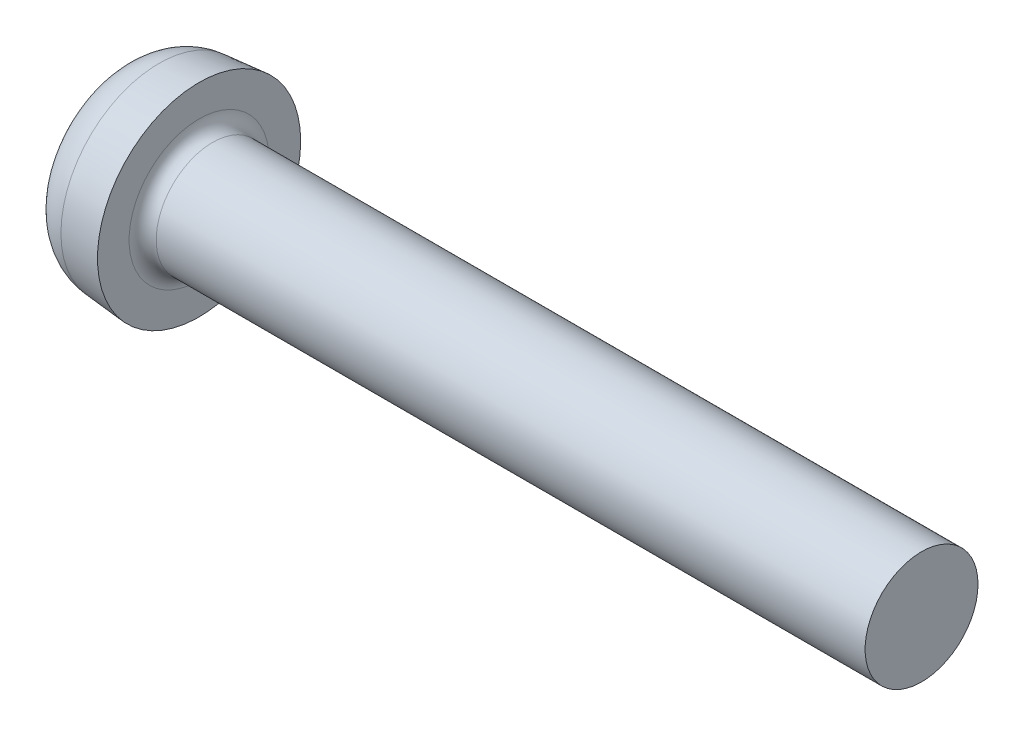
ISO-10303-21;
HEADER;
FILE_DESCRIPTION(('STEP AP214'),'2;1');
FILE_NAME('part.step','',(''),(''),'','','');
FILE_SCHEMA(('AUTOMOTIVE_DESIGN { 1 0 10303 214 1 1 1 1 }'));
ENDSEC;
DATA;
#1=APPLICATION_CONTEXT('core data for automotive mechanical design processes');
#2=APPLICATION_PROTOCOL_DEFINITION('international standard','automotive_design',2000,#1);
#3=PRODUCT_CONTEXT('',#1,'mechanical');
#4=PRODUCT('Part','Part','',(#3));
#5=PRODUCT_RELATED_PRODUCT_CATEGORY('part','',(#4));
#6=PRODUCT_DEFINITION_FORMATION('','',#4);
#7=PRODUCT_DEFINITION_CONTEXT('part definition',#1,'design');
#8=PRODUCT_DEFINITION('design','',#6,#7);
#9=PRODUCT_DEFINITION_SHAPE('','',#8);
#10=(LENGTH_UNIT() NAMED_UNIT(*) SI_UNIT(.MILLI.,.METRE.));
#11=(NAMED_UNIT(*) PLANE_ANGLE_UNIT() SI_UNIT($,.RADIAN.));
#12=(NAMED_UNIT(*) SI_UNIT($,.STERADIAN.) SOLID_ANGLE_UNIT());
#13=UNCERTAINTY_MEASURE_WITH_UNIT(LENGTH_MEASURE(1.E-05),#10,'distance_accuracy_value','');
#14=(GEOMETRIC_REPRESENTATION_CONTEXT(3) GLOBAL_UNCERTAINTY_ASSIGNED_CONTEXT((#13)) GLOBAL_UNIT_ASSIGNED_CONTEXT((#10,
#11,#12)) REPRESENTATION_CONTEXT('',''));
#15=CARTESIAN_POINT('',(0.,0.,0.));
#16=DIRECTION('',(0.,0.,1.));
#17=DIRECTION('',(1.,0.,0.));
#18=AXIS2_PLACEMENT_3D('',#15,#16,#17);
#19=CARTESIAN_POINT('',(0.,0.,0.));
#20=DIRECTION('',(-1.,0.,0.));
#21=DIRECTION('',(0.,0.,1.));
#22=AXIS2_PLACEMENT_3D('',#19,#20,#21);
#23=PLANE('',#22);
#24=DIRECTION('',(0.,1.,0.));
#25=VECTOR('',#24,1.);
#26=CARTESIAN_POINT('',(0.,0.27,-0.27));
#27=LINE('',#26,#25);
#28=CARTESIAN_POINT('',(0.,0.57,-0.27));
#29=VERTEX_POINT('',#28);
#30=CARTESIAN_POINT('',(0.,1.14477993894734,-0.27));
#31=VERTEX_POINT('',#30);
#32=EDGE_CURVE('E331',#29,#31,#27,.T.);
#33=ORIENTED_EDGE('',*,*,#32,.T.);
#34=CARTESIAN_POINT('',(0.,0.,0.));
#35=DIRECTION('',(-1.,0.,0.));
#36=DIRECTION('',(0.,0.,1.));
#37=AXIS2_PLACEMENT_3D('',#34,#35,#36);
#38=CIRCLE('',#37,1.17618923163591);
#39=CARTESIAN_POINT('',(0.,0.27,-1.14477993894734));
#40=VERTEX_POINT('',#39);
#41=EDGE_CURVE('E296',#31,#40,#38,.T.);
#42=ORIENTED_EDGE('',*,*,#41,.T.);
#43=DIRECTION('',(0.,0.,1.));
#44=VECTOR('',#43,1.);
#45=CARTESIAN_POINT('',(0.,0.27,-0.27));
#46=LINE('',#45,#44);
#47=CARTESIAN_POINT('',(0.,0.27,-0.57));
#48=VERTEX_POINT('',#47);
#49=EDGE_CURVE('E309',#40,#48,#46,.T.);
#50=ORIENTED_EDGE('',*,*,#49,.T.);
#51=CARTESIAN_POINT('',(0.,0.57,-0.57));
#52=DIRECTION('',(-1.,0.,0.));
#53=DIRECTION('',(0.,0.,1.));
#54=AXIS2_PLACEMENT_3D('',#51,#52,#53);
#55=CIRCLE('',#54,0.3);
#56=EDGE_CURVE('E358',#48,#29,#55,.T.);
#57=ORIENTED_EDGE('',*,*,#56,.T.);
#58=EDGE_LOOP('',(#33,#42,#50,#57));
#59=FACE_BOUND('',#58,.T.);
#60=ADVANCED_FACE('F38',(#59),#23,.T.);
#61=DIRECTION('',(0.,0.,-1.));
#62=VECTOR('',#61,1.);
#63=CARTESIAN_POINT('',(0.,-0.27,-0.27));
#64=LINE('',#63,#62);
#65=CARTESIAN_POINT('',(0.,-0.27,-0.57));
#66=VERTEX_POINT('',#65);
#67=CARTESIAN_POINT('',(0.,-0.27,-1.14477993894734));
#68=VERTEX_POINT('',#67);
#69=EDGE_CURVE('E324',#66,#68,#64,.T.);
#70=ORIENTED_EDGE('',*,*,#69,.T.);
#71=CARTESIAN_POINT('',(0.,0.,0.));
#72=DIRECTION('',(-1.,0.,0.));
#73=DIRECTION('',(0.,0.,1.));
#74=AXIS2_PLACEMENT_3D('',#71,#72,#73);
#75=CIRCLE('',#74,1.17618923163591);
#76=CARTESIAN_POINT('',(0.,-1.14477993894734,-0.27));
#77=VERTEX_POINT('',#76);
#78=EDGE_CURVE('E288',#68,#77,#75,.T.);
#79=ORIENTED_EDGE('',*,*,#78,.T.);
#80=DIRECTION('',(0.,1.,0.));
#81=VECTOR('',#80,1.);
#82=CARTESIAN_POINT('',(0.,-0.27,-0.27));
#83=LINE('',#82,#81);
#84=CARTESIAN_POINT('',(0.,-0.57,-0.27));
#85=VERTEX_POINT('',#84);
#86=EDGE_CURVE('E112',#77,#85,#83,.T.);
#87=ORIENTED_EDGE('',*,*,#86,.T.);
#88=CARTESIAN_POINT('',(0.,-0.57,-0.57));
#89=DIRECTION('',(-1.,0.,0.));
#90=DIRECTION('',(0.,0.,1.));
#91=AXIS2_PLACEMENT_3D('',#88,#89,#90);
#92=CIRCLE('',#91,0.3);
#93=EDGE_CURVE('E329',#85,#66,#92,.T.);
#94=ORIENTED_EDGE('',*,*,#93,.T.);
#95=EDGE_LOOP('',(#70,#79,#87,#94));
#96=FACE_BOUND('',#95,.T.);
#97=ADVANCED_FACE('F239',(#96),#23,.T.);
#98=DIRECTION('',(0.,-1.,0.));
#99=VECTOR('',#98,1.);
#100=CARTESIAN_POINT('',(0.,-0.27,0.27));
#101=LINE('',#100,#99);
#102=CARTESIAN_POINT('',(0.,-0.57,0.27));
#103=VERTEX_POINT('',#102);
#104=CARTESIAN_POINT('',(0.,-1.14477993894734,0.269999999999999));
#105=VERTEX_POINT('',#104);
#106=EDGE_CURVE('E333',#103,#105,#101,.T.);
#107=ORIENTED_EDGE('',*,*,#106,.T.);
#108=CARTESIAN_POINT('',(0.,0.,0.));
#109=DIRECTION('',(-1.,0.,0.));
#110=DIRECTION('',(0.,0.,1.));
#111=AXIS2_PLACEMENT_3D('',#108,#109,#110);
#112=CIRCLE('',#111,1.17618923163591);
#113=CARTESIAN_POINT('',(0.,-0.27,1.14477993894734));
#114=VERTEX_POINT('',#113);
#115=EDGE_CURVE('E284',#105,#114,#112,.T.);
#116=ORIENTED_EDGE('',*,*,#115,.T.);
#117=DIRECTION('',(0.,0.,-1.));
#118=VECTOR('',#117,1.);
#119=CARTESIAN_POINT('',(0.,-0.27,0.27));
#120=LINE('',#119,#118);
#121=CARTESIAN_POINT('',(0.,-0.27,0.57));
#122=VERTEX_POINT('',#121);
#123=EDGE_CURVE('E279',#114,#122,#120,.T.);
#124=ORIENTED_EDGE('',*,*,#123,.T.);
#125=CARTESIAN_POINT('',(0.,-0.57,0.57));
#126=DIRECTION('',(-1.,0.,0.));
#127=DIRECTION('',(0.,0.,1.));
#128=AXIS2_PLACEMENT_3D('',#125,#126,#127);
#129=CIRCLE('',#128,0.3);
#130=EDGE_CURVE('E363',#122,#103,#129,.T.);
#131=ORIENTED_EDGE('',*,*,#130,.T.);
#132=EDGE_LOOP('',(#107,#116,#124,#131));
#133=FACE_BOUND('',#132,.T.);
#134=ADVANCED_FACE('F246',(#133),#23,.T.);
#135=DIRECTION('',(0.,0.,1.));
#136=VECTOR('',#135,1.);
#137=CARTESIAN_POINT('',(0.,0.27,0.27));
#138=LINE('',#137,#136);
#139=CARTESIAN_POINT('',(0.,0.27,0.57));
#140=VERTEX_POINT('',#139);
#141=CARTESIAN_POINT('',(0.,0.27,1.14477993894734));
#142=VERTEX_POINT('',#141);
#143=EDGE_CURVE('E265',#140,#142,#138,.T.);
#144=ORIENTED_EDGE('',*,*,#143,.T.);
#145=CARTESIAN_POINT('',(0.,0.,0.));
#146=DIRECTION('',(-1.,0.,0.));
#147=DIRECTION('',(0.,0.,1.));
#148=AXIS2_PLACEMENT_3D('',#145,#146,#147);
#149=CIRCLE('',#148,1.17618923163591);
#150=CARTESIAN_POINT('',(0.,1.14477993894734,0.27));
#151=VERTEX_POINT('',#150);
#152=EDGE_CURVE('E269',#142,#151,#149,.T.);
#153=ORIENTED_EDGE('',*,*,#152,.T.);
#154=DIRECTION('',(0.,-1.,0.));
#155=VECTOR('',#154,1.);
#156=CARTESIAN_POINT('',(0.,0.27,0.27));
#157=LINE('',#156,#155);
#158=CARTESIAN_POINT('',(0.,0.57,0.27));
#159=VERTEX_POINT('',#158);
#160=EDGE_CURVE('E338',#151,#159,#157,.T.);
#161=ORIENTED_EDGE('',*,*,#160,.T.);
#162=CARTESIAN_POINT('',(0.,0.57,0.57));
#163=DIRECTION('',(-1.,0.,0.));
#164=DIRECTION('',(0.,0.,1.));
#165=AXIS2_PLACEMENT_3D('',#162,#163,#164);
#166=CIRCLE('',#165,0.3);
#167=EDGE_CURVE('E273',#159,#140,#166,.T.);
#168=ORIENTED_EDGE('',*,*,#167,.T.);
#169=EDGE_LOOP('',(#144,#153,#161,#168));
#170=FACE_BOUND('',#169,.T.);
#171=ADVANCED_FACE('F242',(#170),#23,.T.);
#172=CARTESIAN_POINT('',(17.8,1.25,0.));
#173=DIRECTION('',(1.,0.,0.));
#174=DIRECTION('',(0.,0.,-1.));
#175=AXIS2_PLACEMENT_3D('',#172,#173,#174);
#176=PLANE('',#175);
#177=CARTESIAN_POINT('',(17.8,0.,0.));
#178=DIRECTION('',(1.,0.,0.));
#179=DIRECTION('',(0.,0.,-1.));
#180=AXIS2_PLACEMENT_3D('',#177,#178,#179);
#181=CIRCLE('',#180,1.25);
#182=CARTESIAN_POINT('',(17.8,0.,-1.25));
#183=VERTEX_POINT('',#182);
#184=EDGE_CURVE('E352',#183,#183,#181,.T.);
#185=ORIENTED_EDGE('',*,*,#184,.T.);
#186=EDGE_LOOP('',(#185));
#187=FACE_BOUND('',#186,.T.);
#188=ADVANCED_FACE('F251',(#187),#176,.T.);
#189=CARTESIAN_POINT('',(4.51581291088132,0.,0.));
#190=DIRECTION('',(1.,0.,0.));
#191=DIRECTION('',(0.,0.,-1.));
#192=AXIS2_PLACEMENT_3D('',#189,#190,#191);
#193=CYLINDRICAL_SURFACE('',#192,1.25);
#194=CARTESIAN_POINT('',(2.1,0.,0.));
#195=DIRECTION('',(1.,0.,0.));
#196=DIRECTION('',(0.,0.,-1.));
#197=AXIS2_PLACEMENT_3D('',#194,#195,#196);
#198=CIRCLE('',#197,1.25);
#199=CARTESIAN_POINT('',(2.1,0.,-1.25));
#200=VERTEX_POINT('',#199);
#201=EDGE_CURVE('E349',#200,#200,#198,.T.);
#202=ORIENTED_EDGE('',*,*,#201,.T.);
#203=EDGE_LOOP('',(#202));
#204=FACE_BOUND('',#203,.T.);
#205=ORIENTED_EDGE('',*,*,#184,.F.);
#206=EDGE_LOOP('',(#205));
#207=FACE_BOUND('',#206,.T.);
#208=ADVANCED_FACE('F257',(#204,#207),#193,.T.);
#209=CARTESIAN_POINT('',(2.1,0.,0.));
#210=DIRECTION('',(1.,0.,0.));
#211=DIRECTION('',(0.,0.,-1.));
#212=AXIS2_PLACEMENT_3D('',#209,#210,#211);
#213=TOROIDAL_SURFACE('',#212,1.55,0.3);
#214=CARTESIAN_POINT('',(1.8,0.,0.));
#215=DIRECTION('',(1.,0.,0.));
#216=DIRECTION('',(0.,0.,-1.));
#217=AXIS2_PLACEMENT_3D('',#214,#215,#216);
#218=CIRCLE('',#217,1.55);
#219=CARTESIAN_POINT('',(1.8,0.,-1.55));
#220=VERTEX_POINT('',#219);
#221=EDGE_CURVE('E345',#220,#220,#218,.T.);
#222=ORIENTED_EDGE('',*,*,#221,.T.);
#223=EDGE_LOOP('',(#222));
#224=FACE_BOUND('',#223,.T.);
#225=ORIENTED_EDGE('',*,*,#201,.F.);
#226=EDGE_LOOP('',(#225));
#227=FACE_BOUND('',#226,.T.);
#228=ADVANCED_FACE('F517',(#224,#227),#213,.F.);
#229=CARTESIAN_POINT('',(1.8,1.55,0.));
#230=DIRECTION('',(1.,0.,0.));
#231=DIRECTION('',(0.,0.,-1.));
#232=AXIS2_PLACEMENT_3D('',#229,#230,#231);
#233=PLANE('',#232);
#234=CARTESIAN_POINT('',(1.8,0.,0.));
#235=DIRECTION('',(1.,0.,0.));
#236=DIRECTION('',(0.,0.,-1.));
#237=AXIS2_PLACEMENT_3D('',#234,#235,#236);
#238=CIRCLE('',#237,2.25);
#239=CARTESIAN_POINT('',(1.8,0.,-2.25));
#240=VERTEX_POINT('',#239);
#241=EDGE_CURVE('E341',#240,#240,#238,.T.);
#242=ORIENTED_EDGE('',*,*,#241,.T.);
#243=EDGE_LOOP('',(#242));
#244=FACE_BOUND('',#243,.T.);
#245=ORIENTED_EDGE('',*,*,#221,.F.);
#246=EDGE_LOOP('',(#245));
#247=FACE_BOUND('',#246,.T.);
#248=ADVANCED_FACE('F521',(#244,#247),#233,.T.);
#249=CARTESIAN_POINT('',(1.8,0.,0.));
#250=DIRECTION('',(1.,0.,0.));
#251=DIRECTION('',(0.,0.,-1.));
#252=AXIS2_PLACEMENT_3D('',#249,#250,#251);
#253=CONICAL_SURFACE('',#252,2.25,0.0872664625997204);
#254=CARTESIAN_POINT('',(0.91284425725234,0.,0.));
#255=DIRECTION('',(-1.,0.,0.));
#256=DIRECTION('',(0.,0.,1.));
#257=AXIS2_PLACEMENT_3D('',#254,#255,#256);
#258=CIRCLE('',#257,2.17238392972765);
#259=CARTESIAN_POINT('',(0.91284425725234,0.,2.17238392972765));
#260=VERTEX_POINT('',#259);
#261=EDGE_CURVE('E285',#260,#260,#258,.F.);
#262=ORIENTED_EDGE('',*,*,#261,.T.);
#263=EDGE_LOOP('',(#262));
#264=FACE_BOUND('',#263,.T.);
#265=ORIENTED_EDGE('',*,*,#241,.F.);
#266=EDGE_LOOP('',(#265));
#267=FACE_BOUND('',#266,.T.);
#268=ADVANCED_FACE('F524',(#264,#267),#253,.T.);
#269=CARTESIAN_POINT('',(1.8,0.27,0.27));
#270=DIRECTION('',(0.,-1.,0.));
#271=DIRECTION('',(0.,0.,-1.));
#272=AXIS2_PLACEMENT_3D('',#269,#270,#271);
#273=PLANE('',#272);
#274=DIRECTION('',(-0.939692620785908,0.,0.342020143325669));
#275=VECTOR('',#274,1.);
#276=CARTESIAN_POINT('',(0.,0.27,1.35));
#277=LINE('',#276,#275);
#278=CARTESIAN_POINT('',(1.8,0.27,0.694853578320835));
#279=VERTEX_POINT('',#278);
#280=CARTESIAN_POINT('',(0.0189552904100911,0.27,1.34310083850886));
#281=VERTEX_POINT('',#280);
#282=EDGE_CURVE('E346',#279,#281,#277,.T.);
#283=ORIENTED_EDGE('',*,*,#282,.T.);
#284=CARTESIAN_POINT('',(0.0203157207396354,0.27,1.35));
#285=CARTESIAN_POINT('',(0.0135384514944248,0.27,1.31613209189805));
#286=CARTESIAN_POINT('',(0.00845684016559035,0.27,1.28209632316712));
#287=CARTESIAN_POINT('',(0.00168498938565618,0.27,1.21368963059269));
#288=CARTESIAN_POINT('',(-5.30619872119063E-06,0.27,1.17931871230606));
#289=CARTESIAN_POINT('',(0.,0.27,1.14477993894734));
#290=B_SPLINE_CURVE_WITH_KNOTS('',3,(#284,#285,#286,#287,#288,#289),.UNSPECIFIED.,.F.,.F.,(4,2,
4),(0.,0.103239076619376,0.206476444404777),.UNSPECIFIED.);
#291=EDGE_CURVE('E182',#281,#142,#290,.T.);
#292=ORIENTED_EDGE('',*,*,#291,.T.);
#293=ORIENTED_EDGE('',*,*,#143,.F.);
#294=DIRECTION('',(-1.,0.,0.));
#295=VECTOR('',#294,1.);
#296=CARTESIAN_POINT('',(1.8,0.27,0.57));
#297=LINE('',#296,#295);
#298=CARTESIAN_POINT('',(1.8,0.27,0.57));
#299=VERTEX_POINT('',#298);
#300=EDGE_CURVE('E376',#140,#299,#297,.F.);
#301=ORIENTED_EDGE('',*,*,#300,.T.);
#302=DIRECTION('',(0.,0.,1.));
#303=VECTOR('',#302,1.);
#304=CARTESIAN_POINT('',(1.8,0.27,0.27));
#305=LINE('',#304,#303);
#306=EDGE_CURVE('E340',#299,#279,#305,.T.);
#307=ORIENTED_EDGE('',*,*,#306,.T.);
#308=EDGE_LOOP('',(#283,#292,#293,#301,#307));
#309=FACE_BOUND('',#308,.T.);
#310=ADVANCED_FACE('F431',(#309),#273,.T.);
#311=CARTESIAN_POINT('',(0.,0.,1.35));
#312=DIRECTION('',(-0.342020143325669,0.,-0.939692620785908));
#313=DIRECTION('',(-0.939692620785908,0.,0.342020143325669));
#314=AXIS2_PLACEMENT_3D('',#311,#312,#313);
#315=PLANE('',#314);
#316=DIRECTION('',(-0.939692620785908,0.,0.342020143325669));
#317=VECTOR('',#316,1.);
#318=CARTESIAN_POINT('',(1.93654530803781,-0.27,0.645155150566362));
#319=LINE('',#318,#317);
#320=CARTESIAN_POINT('',(1.8,-0.27,0.694853578320835));
#321=VERTEX_POINT('',#320);
#322=CARTESIAN_POINT('',(0.0189552904100914,-0.27,1.34310083850886));
#323=VERTEX_POINT('',#322);
#324=EDGE_CURVE('E427',#321,#323,#319,.T.);
#325=ORIENTED_EDGE('',*,*,#324,.T.);
#326=CARTESIAN_POINT('',(0.0189552904100914,-0.27,1.34310083850886));
#327=CARTESIAN_POINT('',(0.0173404956379647,-0.225013418328049,1.34368857574036));
#328=CARTESIAN_POINT('',(0.0161804314795191,-0.180011121972337,1.34411080456387));
#329=CARTESIAN_POINT('',(0.0146680717184275,-0.0900058802395551,1.34466125850041));
#330=CARTESIAN_POINT('',(0.0143155059190488,-0.0450029401197797,1.34478958195701));
#331=CARTESIAN_POINT('',(0.01431550591906,0.0450029401197698,1.344789581957));
#332=CARTESIAN_POINT('',(0.0146680717184497,0.0900058802395437,1.3446612585004));
#333=CARTESIAN_POINT('',(0.0161804314794968,0.180011121972324,1.34411080456388));
#334=CARTESIAN_POINT('',(0.0173404956378866,0.225013418328037,1.34368857574039));
#335=CARTESIAN_POINT('',(0.0189552904098906,0.269999999999991,1.34310083850893));
#336=B_SPLINE_CURVE_WITH_KNOTS('',3,(#326,#327,#328,#329,#330,#331,#332,#333,#334,#335),
.UNSPECIFIED.,.F.,.F.,(4,2,2,2,4),(0.,0.135051320541643,0.270057445003857,0.405063569466068,
0.540114890007708),.UNSPECIFIED.);
#337=EDGE_CURVE('E135',#323,#281,#336,.T.);
#338=ORIENTED_EDGE('',*,*,#337,.T.);
#339=ORIENTED_EDGE('',*,*,#282,.F.);
#340=DIRECTION('',(0.,-1.,0.));
#341=VECTOR('',#340,1.);
#342=CARTESIAN_POINT('',(1.8,0.,0.694853578320835));
#343=LINE('',#342,#341);
#344=EDGE_CURVE('E434',#279,#321,#343,.T.);
#345=ORIENTED_EDGE('',*,*,#344,.T.);
#346=EDGE_LOOP('',(#325,#338,#339,#345));
#347=FACE_BOUND('',#346,.T.);
#348=ADVANCED_FACE('F162',(#347),#315,.T.);
#349=CARTESIAN_POINT('',(1.8,-0.27,0.27));
#350=DIRECTION('',(0.,1.,0.));
#351=DIRECTION('',(0.,0.,1.));
#352=AXIS2_PLACEMENT_3D('',#349,#350,#351);
#353=PLANE('',#352);
#354=ORIENTED_EDGE('',*,*,#123,.F.);
#355=CARTESIAN_POINT('',(0.,-0.27,1.14477993894734));
#356=CARTESIAN_POINT('',(-5.30619872117063E-06,-0.27,1.17931871230606));
#357=CARTESIAN_POINT('',(0.00168498938565621,-0.27,1.21368963059269));
#358=CARTESIAN_POINT('',(0.0084568401655904,-0.27,1.28209632316712));
#359=CARTESIAN_POINT('',(0.0135384514944249,-0.27,1.31613209189805));
#360=CARTESIAN_POINT('',(0.0203157207396355,-0.27,1.35));
#361=B_SPLINE_CURVE_WITH_KNOTS('',3,(#355,#356,#357,#358,#359,#360),.UNSPECIFIED.,.F.,.F.,(4,2,
4),(0.,0.103237367785402,0.206476444404777),.UNSPECIFIED.);
#362=EDGE_CURVE('E129',#114,#323,#361,.T.);
#363=ORIENTED_EDGE('',*,*,#362,.T.);
#364=ORIENTED_EDGE('',*,*,#324,.F.);
#365=DIRECTION('',(0.,0.,-1.));
#366=VECTOR('',#365,1.);
#367=CARTESIAN_POINT('',(1.8,-0.27,0.27));
#368=LINE('',#367,#366);
#369=CARTESIAN_POINT('',(1.8,-0.27,0.57));
#370=VERTEX_POINT('',#369);
#371=EDGE_CURVE('E435',#321,#370,#368,.T.);
#372=ORIENTED_EDGE('',*,*,#371,.T.);
#373=DIRECTION('',(-1.,0.,0.));
#374=VECTOR('',#373,1.);
#375=CARTESIAN_POINT('',(1.8,-0.27,0.57));
#376=LINE('',#375,#374);
#377=EDGE_CURVE('E355',#370,#122,#376,.T.);
#378=ORIENTED_EDGE('',*,*,#377,.T.);
#379=EDGE_LOOP('',(#354,#363,#364,#372,#378));
#380=FACE_BOUND('',#379,.T.);
#381=ADVANCED_FACE('F461',(#380),#353,.T.);
#382=CARTESIAN_POINT('',(1.8,-0.27,0.27));
#383=DIRECTION('',(0.,0.,-1.));
#384=DIRECTION('',(0.,1.,0.));
#385=AXIS2_PLACEMENT_3D('',#382,#383,#384);
#386=PLANE('',#385);
#387=DIRECTION('',(-0.939692620785908,-0.342020143325669,0.));
#388=VECTOR('',#387,1.);
#389=CARTESIAN_POINT('',(0.,-1.35,0.269999999999999));
#390=LINE('',#389,#388);
#391=CARTESIAN_POINT('',(1.8,-0.694853578320834,0.27));
#392=VERTEX_POINT('',#391);
#393=CARTESIAN_POINT('',(0.0189552904100909,-1.34310083850885,0.269999999999999));
#394=VERTEX_POINT('',#393);
#395=EDGE_CURVE('E119',#392,#394,#390,.T.);
#396=ORIENTED_EDGE('',*,*,#395,.T.);
#397=CARTESIAN_POINT('',(0.0203157207396352,-1.35,0.269999999999999));
#398=CARTESIAN_POINT('',(0.0135384514944246,-1.31613209189804,0.269999999999999));
#399=CARTESIAN_POINT('',(0.00845684016559024,-1.28209632316712,0.269999999999999));
#400=CARTESIAN_POINT('',(0.00168498938565618,-1.21368963059269,0.269999999999999));
#401=CARTESIAN_POINT('',(-5.30619872113723E-06,-1.17931871230606,0.269999999999999));
#402=CARTESIAN_POINT('',(0.,-1.14477993894734,0.269999999999999));
#403=B_SPLINE_CURVE_WITH_KNOTS('',3,(#397,#398,#399,#400,#401,#402),.UNSPECIFIED.,.F.,.F.,(4,2,
4),(0.,0.103239076619375,0.206476444404776),.UNSPECIFIED.);
#404=EDGE_CURVE('E128',#394,#105,#403,.T.);
#405=ORIENTED_EDGE('',*,*,#404,.T.);
#406=ORIENTED_EDGE('',*,*,#106,.F.);
#407=DIRECTION('',(-1.,0.,0.));
#408=VECTOR('',#407,1.);
#409=CARTESIAN_POINT('',(1.8,-0.57,0.27));
#410=LINE('',#409,#408);
#411=CARTESIAN_POINT('',(1.8,-0.57,0.27));
#412=VERTEX_POINT('',#411);
#413=EDGE_CURVE('E366',#103,#412,#410,.F.);
#414=ORIENTED_EDGE('',*,*,#413,.T.);
#415=DIRECTION('',(0.,-1.,0.));
#416=VECTOR('',#415,1.);
#417=CARTESIAN_POINT('',(1.8,-0.27,0.27));
#418=LINE('',#417,#416);
#419=EDGE_CURVE('E437',#412,#392,#418,.T.);
#420=ORIENTED_EDGE('',*,*,#419,.T.);
#421=EDGE_LOOP('',(#396,#405,#406,#414,#420));
#422=FACE_BOUND('',#421,.T.);
#423=ADVANCED_FACE('F153',(#422),#386,.T.);
#424=CARTESIAN_POINT('',(0.,-1.35,0.));
#425=DIRECTION('',(-0.342020143325669,0.939692620785908,0.));
#426=DIRECTION('',(-0.939692620785908,-0.342020143325669,0.));
#427=AXIS2_PLACEMENT_3D('',#424,#425,#426);
#428=PLANE('',#427);
#429=DIRECTION('',(-0.939692620785908,-0.342020143325669,0.));
#430=VECTOR('',#429,1.);
#431=CARTESIAN_POINT('',(1.93654530803781,-0.645155150566361,-0.27));
#432=LINE('',#431,#430);
#433=CARTESIAN_POINT('',(1.8,-0.694853578320834,-0.27));
#434=VERTEX_POINT('',#433);
#435=CARTESIAN_POINT('',(0.018955290410091,-1.34310083850885,-0.27));
#436=VERTEX_POINT('',#435);
#437=EDGE_CURVE('E107',#434,#436,#432,.T.);
#438=ORIENTED_EDGE('',*,*,#437,.T.);
#439=CARTESIAN_POINT('',(0.018955290410091,-1.34310083850885,-0.27));
#440=CARTESIAN_POINT('',(0.0173404956379644,-1.34368857574036,-0.225013418328049));
#441=CARTESIAN_POINT('',(0.0161804314795189,-1.34411080456387,-0.180011121972336));
#442=CARTESIAN_POINT('',(0.0146680717184273,-1.34466125850041,-0.090005880239555));
#443=CARTESIAN_POINT('',(0.0143155059190487,-1.344789581957,-0.0450029401197796));
#444=CARTESIAN_POINT('',(0.0143155059190598,-1.344789581957,0.0450029401197697));
#445=CARTESIAN_POINT('',(0.0146680717184495,-1.3446612585004,0.0900058802395437));
#446=CARTESIAN_POINT('',(0.0161804314794964,-1.34411080456388,0.180011121972324));
#447=CARTESIAN_POINT('',(0.0173404956378862,-1.34368857574039,0.225013418328037));
#448=CARTESIAN_POINT('',(0.0189552904098904,-1.34310083850893,0.269999999999991));
#449=B_SPLINE_CURVE_WITH_KNOTS('',3,(#439,#440,#441,#442,#443,#444,#445,#446,#447,#448),
.UNSPECIFIED.,.F.,.F.,(4,2,2,2,4),(0.,0.135051320541643,0.270057445003857,0.405063569466068,
0.540114890007708),.UNSPECIFIED.);
#450=EDGE_CURVE('E43',#436,#394,#449,.T.);
#451=ORIENTED_EDGE('',*,*,#450,.T.);
#452=ORIENTED_EDGE('',*,*,#395,.F.);
#453=DIRECTION('',(0.,0.,-1.));
#454=VECTOR('',#453,1.);
#455=CARTESIAN_POINT('',(1.8,-0.694853578320834,0.));
#456=LINE('',#455,#454);
#457=EDGE_CURVE('E118',#392,#434,#456,.T.);
#458=ORIENTED_EDGE('',*,*,#457,.T.);
#459=EDGE_LOOP('',(#438,#451,#452,#458));
#460=FACE_BOUND('',#459,.T.);
#461=ADVANCED_FACE('F40',(#460),#428,.T.);
#462=CARTESIAN_POINT('',(1.8,-0.27,-0.27));
#463=DIRECTION('',(0.,0.,1.));
#464=DIRECTION('',(1.,0.,0.));
#465=AXIS2_PLACEMENT_3D('',#462,#463,#464);
#466=PLANE('',#465);
#467=ORIENTED_EDGE('',*,*,#86,.F.);
#468=CARTESIAN_POINT('',(0.,-1.14477993894734,-0.27));
#469=CARTESIAN_POINT('',(-5.30619872120928E-06,-1.17931871230606,-0.27));
#470=CARTESIAN_POINT('',(0.00168498938565612,-1.21368963059269,-0.27));
#471=CARTESIAN_POINT('',(0.00845684016559022,-1.28209632316712,-0.27));
#472=CARTESIAN_POINT('',(0.0135384514944246,-1.31613209189804,-0.27));
#473=CARTESIAN_POINT('',(0.0203157207396352,-1.35,-0.27));
#474=B_SPLINE_CURVE_WITH_KNOTS('',3,(#468,#469,#470,#471,#472,#473),.UNSPECIFIED.,.F.,.F.,(4,2,
4),(0.,0.103237367785401,0.206476444404776),.UNSPECIFIED.);
#475=EDGE_CURVE('E104',#77,#436,#474,.T.);
#476=ORIENTED_EDGE('',*,*,#475,.T.);
#477=ORIENTED_EDGE('',*,*,#437,.F.);
#478=DIRECTION('',(0.,1.,0.));
#479=VECTOR('',#478,1.);
#480=CARTESIAN_POINT('',(1.8,-0.27,-0.27));
#481=LINE('',#480,#479);
#482=CARTESIAN_POINT('',(1.8,-0.57,-0.27));
#483=VERTEX_POINT('',#482);
#484=EDGE_CURVE('E442',#434,#483,#481,.T.);
#485=ORIENTED_EDGE('',*,*,#484,.T.);
#486=DIRECTION('',(-1.,0.,0.));
#487=VECTOR('',#486,1.);
#488=CARTESIAN_POINT('',(1.8,-0.57,-0.27));
#489=LINE('',#488,#487);
#490=EDGE_CURVE('E369',#483,#85,#489,.T.);
#491=ORIENTED_EDGE('',*,*,#490,.T.);
#492=EDGE_LOOP('',(#467,#476,#477,#485,#491));
#493=FACE_BOUND('',#492,.T.);
#494=ADVANCED_FACE('F105',(#493),#466,.T.);
#495=CARTESIAN_POINT('',(1.8,-0.27,-0.27));
#496=DIRECTION('',(0.,1.,0.));
#497=DIRECTION('',(0.,0.,1.));
#498=AXIS2_PLACEMENT_3D('',#495,#496,#497);
#499=PLANE('',#498);
#500=DIRECTION('',(-0.939692620785908,0.,-0.342020143325669));
#501=VECTOR('',#500,1.);
#502=CARTESIAN_POINT('',(0.,-0.27,-1.35));
#503=LINE('',#502,#501);
#504=CARTESIAN_POINT('',(1.8,-0.27,-0.694853578320835));
#505=VERTEX_POINT('',#504);
#506=CARTESIAN_POINT('',(0.0189552904100912,-0.27,-1.34310083850886));
#507=VERTEX_POINT('',#506);
#508=EDGE_CURVE('E120',#505,#507,#503,.T.);
#509=ORIENTED_EDGE('',*,*,#508,.T.);
#510=CARTESIAN_POINT('',(0.0203157207396356,-0.27,-1.35));
#511=CARTESIAN_POINT('',(0.0135384514944248,-0.27,-1.31613209189805));
#512=CARTESIAN_POINT('',(0.00845684016559029,-0.27,-1.28209632316712));
#513=CARTESIAN_POINT('',(0.00168498938565608,-0.27,-1.21368963059269));
#514=CARTESIAN_POINT('',(-5.30619872124907E-06,-0.27,-1.17931871230606));
#515=CARTESIAN_POINT('',(0.,-0.27,-1.14477993894734));
#516=B_SPLINE_CURVE_WITH_KNOTS('',3,(#510,#511,#512,#513,#514,#515),.UNSPECIFIED.,.F.,.F.,(4,2,
4),(0.,0.103239076619376,0.206476444404778),.UNSPECIFIED.);
#517=EDGE_CURVE('E115',#507,#68,#516,.T.);
#518=ORIENTED_EDGE('',*,*,#517,.T.);
#519=ORIENTED_EDGE('',*,*,#69,.F.);
#520=DIRECTION('',(-1.,0.,0.));
#521=VECTOR('',#520,1.);
#522=CARTESIAN_POINT('',(1.8,-0.27,-0.57));
#523=LINE('',#522,#521);
#524=CARTESIAN_POINT('',(1.8,-0.27,-0.57));
#525=VERTEX_POINT('',#524);
#526=EDGE_CURVE('E371',#66,#525,#523,.F.);
#527=ORIENTED_EDGE('',*,*,#526,.T.);
#528=DIRECTION('',(0.,0.,-1.));
#529=VECTOR('',#528,1.);
#530=CARTESIAN_POINT('',(1.8,-0.27,-0.27));
#531=LINE('',#530,#529);
#532=EDGE_CURVE('E444',#525,#505,#531,.T.);
#533=ORIENTED_EDGE('',*,*,#532,.T.);
#534=EDGE_LOOP('',(#509,#518,#519,#527,#533));
#535=FACE_BOUND('',#534,.T.);
#536=ADVANCED_FACE('F224',(#535),#499,.T.);
#537=CARTESIAN_POINT('',(0.,0.,-1.35));
#538=DIRECTION('',(-0.342020143325669,0.,0.939692620785908));
#539=DIRECTION('',(0.939692620785908,0.,0.342020143325669));
#540=AXIS2_PLACEMENT_3D('',#537,#538,#539);
#541=PLANE('',#540);
#542=DIRECTION('',(-0.939692620785908,0.,-0.342020143325669));
#543=VECTOR('',#542,1.);
#544=CARTESIAN_POINT('',(1.93654530803781,0.27,-0.645155150566362));
#545=LINE('',#544,#543);
#546=CARTESIAN_POINT('',(1.8,0.27,-0.694853578320835));
#547=VERTEX_POINT('',#546);
#548=CARTESIAN_POINT('',(0.0189552904100913,0.27,-1.34310083850886));
#549=VERTEX_POINT('',#548);
#550=EDGE_CURVE('E306',#547,#549,#545,.T.);
#551=ORIENTED_EDGE('',*,*,#550,.T.);
#552=CARTESIAN_POINT('',(0.0189552904100913,0.27,-1.34310083850886));
#553=CARTESIAN_POINT('',(0.0173404956379647,0.225013418328049,-1.34368857574036));
#554=CARTESIAN_POINT('',(0.0161804314795192,0.180011121972336,-1.34411080456387));
#555=CARTESIAN_POINT('',(0.0146680717184278,0.0900058802395547,-1.34466125850041));
#556=CARTESIAN_POINT('',(0.0143155059190492,0.0450029401197793,-1.34478958195701));
#557=CARTESIAN_POINT('',(0.0143155059190602,-0.0450029401197701,-1.344789581957));
#558=CARTESIAN_POINT('',(0.0146680717184498,-0.0900058802395441,-1.3446612585004));
#559=CARTESIAN_POINT('',(0.0161804314794965,-0.180011121972325,-1.34411080456388));
#560=CARTESIAN_POINT('',(0.0173404956378863,-0.225013418328038,-1.34368857574039));
#561=CARTESIAN_POINT('',(0.0189552904098906,-0.269999999999992,-1.34310083850893));
#562=B_SPLINE_CURVE_WITH_KNOTS('',3,(#552,#553,#554,#555,#556,#557,#558,#559,#560,#561),
.UNSPECIFIED.,.F.,.F.,(4,2,2,2,4),(0.,0.135051320541643,0.270057445003857,0.405063569466068,
0.540114890007708),.UNSPECIFIED.);
#563=EDGE_CURVE('E213',#549,#507,#562,.T.);
#564=ORIENTED_EDGE('',*,*,#563,.T.);
#565=ORIENTED_EDGE('',*,*,#508,.F.);
#566=DIRECTION('',(0.,1.,0.));
#567=VECTOR('',#566,1.);
#568=CARTESIAN_POINT('',(1.8,0.,-0.694853578320836));
#569=LINE('',#568,#567);
#570=EDGE_CURVE('E314',#505,#547,#569,.T.);
#571=ORIENTED_EDGE('',*,*,#570,.T.);
#572=EDGE_LOOP('',(#551,#564,#565,#571));
#573=FACE_BOUND('',#572,.T.);
#574=ADVANCED_FACE('F220',(#573),#541,.T.);
#575=CARTESIAN_POINT('',(1.8,0.27,-0.27));
#576=DIRECTION('',(0.,-1.,0.));
#577=DIRECTION('',(0.,0.,-1.));
#578=AXIS2_PLACEMENT_3D('',#575,#576,#577);
#579=PLANE('',#578);
#580=ORIENTED_EDGE('',*,*,#49,.F.);
#581=CARTESIAN_POINT('',(0.,0.27,-1.14477993894734));
#582=CARTESIAN_POINT('',(-5.30619872126949E-06,0.27,-1.17931871230606));
#583=CARTESIAN_POINT('',(0.00168498938565607,0.27,-1.21368963059269));
#584=CARTESIAN_POINT('',(0.00845684016559031,0.27,-1.28209632316712));
#585=CARTESIAN_POINT('',(0.0135384514944249,0.27,-1.31613209189805));
#586=CARTESIAN_POINT('',(0.0203157207396357,0.27,-1.35));
#587=B_SPLINE_CURVE_WITH_KNOTS('',3,(#581,#582,#583,#584,#585,#586),.UNSPECIFIED.,.F.,.F.,(4,2,
4),(0.,0.103237367785402,0.206476444404778),.UNSPECIFIED.);
#588=EDGE_CURVE('E142',#40,#549,#587,.T.);
#589=ORIENTED_EDGE('',*,*,#588,.T.);
#590=ORIENTED_EDGE('',*,*,#550,.F.);
#591=DIRECTION('',(0.,0.,1.));
#592=VECTOR('',#591,1.);
#593=CARTESIAN_POINT('',(1.8,0.27,-0.27));
#594=LINE('',#593,#592);
#595=CARTESIAN_POINT('',(1.8,0.27,-0.57));
#596=VERTEX_POINT('',#595);
#597=EDGE_CURVE('E397',#547,#596,#594,.T.);
#598=ORIENTED_EDGE('',*,*,#597,.T.);
#599=DIRECTION('',(-1.,0.,0.));
#600=VECTOR('',#599,1.);
#601=CARTESIAN_POINT('',(1.8,0.27,-0.57));
#602=LINE('',#601,#600);
#603=EDGE_CURVE('E378',#596,#48,#602,.T.);
#604=ORIENTED_EDGE('',*,*,#603,.T.);
#605=EDGE_LOOP('',(#580,#589,#590,#598,#604));
#606=FACE_BOUND('',#605,.T.);
#607=ADVANCED_FACE('F223',(#606),#579,.T.);
#608=CARTESIAN_POINT('',(1.8,0.27,-0.27));
#609=DIRECTION('',(0.,0.,1.));
#610=DIRECTION('',(1.,0.,0.));
#611=AXIS2_PLACEMENT_3D('',#608,#609,#610);
#612=PLANE('',#611);
#613=DIRECTION('',(-0.939692620785908,0.342020143325669,0.));
#614=VECTOR('',#613,1.);
#615=CARTESIAN_POINT('',(0.,1.35,-0.27));
#616=LINE('',#615,#614);
#617=CARTESIAN_POINT('',(1.8,0.694853578320834,-0.27));
#618=VERTEX_POINT('',#617);
#619=CARTESIAN_POINT('',(0.0189552904100909,1.34310083850885,-0.27));
#620=VERTEX_POINT('',#619);
#621=EDGE_CURVE('E315',#618,#620,#616,.T.);
#622=ORIENTED_EDGE('',*,*,#621,.T.);
#623=CARTESIAN_POINT('',(0.0203157207396352,1.35,-0.27));
#624=CARTESIAN_POINT('',(0.0135384514944246,1.31613209189804,-0.27));
#625=CARTESIAN_POINT('',(0.00845684016559021,1.28209632316712,-0.27));
#626=CARTESIAN_POINT('',(0.00168498938565612,1.21368963059269,-0.27));
#627=CARTESIAN_POINT('',(-5.3061987212088E-06,1.17931871230606,-0.27));
#628=CARTESIAN_POINT('',(0.,1.14477993894734,-0.27));
#629=B_SPLINE_CURVE_WITH_KNOTS('',3,(#623,#624,#625,#626,#627,#628),.UNSPECIFIED.,.F.,.F.,(4,2,
4),(0.,0.103239076619375,0.206476444404776),.UNSPECIFIED.);
#630=EDGE_CURVE('E11',#620,#31,#629,.T.);
#631=ORIENTED_EDGE('',*,*,#630,.T.);
#632=ORIENTED_EDGE('',*,*,#32,.F.);
#633=DIRECTION('',(-1.,0.,0.));
#634=VECTOR('',#633,1.);
#635=CARTESIAN_POINT('',(1.8,0.57,-0.27));
#636=LINE('',#635,#634);
#637=CARTESIAN_POINT('',(1.8,0.57,-0.27));
#638=VERTEX_POINT('',#637);
#639=EDGE_CURVE('E380',#29,#638,#636,.F.);
#640=ORIENTED_EDGE('',*,*,#639,.T.);
#641=DIRECTION('',(0.,1.,0.));
#642=VECTOR('',#641,1.);
#643=CARTESIAN_POINT('',(1.8,0.27,-0.27));
#644=LINE('',#643,#642);
#645=EDGE_CURVE('E401',#638,#618,#644,.T.);
#646=ORIENTED_EDGE('',*,*,#645,.T.);
#647=EDGE_LOOP('',(#622,#631,#632,#640,#646));
#648=FACE_BOUND('',#647,.T.);
#649=ADVANCED_FACE('F230',(#648),#612,.T.);
#650=CARTESIAN_POINT('',(0.,1.35,0.));
#651=DIRECTION('',(-0.342020143325669,-0.939692620785908,0.));
#652=DIRECTION('',(0.939692620785908,-0.342020143325669,0.));
#653=AXIS2_PLACEMENT_3D('',#650,#651,#652);
#654=PLANE('',#653);
#655=DIRECTION('',(-0.939692620785908,0.342020143325669,0.));
#656=VECTOR('',#655,1.);
#657=CARTESIAN_POINT('',(1.93654530803781,0.645155150566361,0.27));
#658=LINE('',#657,#656);
#659=CARTESIAN_POINT('',(1.8,0.694853578320834,0.27));
#660=VERTEX_POINT('',#659);
#661=CARTESIAN_POINT('',(0.0189552904100911,1.34310083850885,0.27));
#662=VERTEX_POINT('',#661);
#663=EDGE_CURVE('E450',#660,#662,#658,.T.);
#664=ORIENTED_EDGE('',*,*,#663,.T.);
#665=CARTESIAN_POINT('',(0.0189552904100911,1.34310083850885,0.27));
#666=CARTESIAN_POINT('',(0.0173404956379642,1.34368857574036,0.225013418328049));
#667=CARTESIAN_POINT('',(0.0161804314795187,1.34411080456387,0.180011121972336));
#668=CARTESIAN_POINT('',(0.0146680717184272,1.34466125850041,0.0900058802395547));
#669=CARTESIAN_POINT('',(0.0143155059190487,1.344789581957,0.0450029401197792));
#670=CARTESIAN_POINT('',(0.0143155059190599,1.344789581957,-0.0450029401197702));
#671=CARTESIAN_POINT('',(0.0146680717184495,1.3446612585004,-0.0900058802395442));
#672=CARTESIAN_POINT('',(0.0161804314794964,1.34411080456388,-0.180011121972325));
#673=CARTESIAN_POINT('',(0.0173404956378862,1.34368857574039,-0.225013418328038));
#674=CARTESIAN_POINT('',(0.0189552904098904,1.34310083850893,-0.269999999999992));
#675=B_SPLINE_CURVE_WITH_KNOTS('',3,(#665,#666,#667,#668,#669,#670,#671,#672,#673,#674),
.UNSPECIFIED.,.F.,.F.,(4,2,2,2,4),(0.,0.135051320541643,0.270057445003857,0.405063569466068,
0.540114890007708),.UNSPECIFIED.);
#676=EDGE_CURVE('E53',#662,#620,#675,.T.);
#677=ORIENTED_EDGE('',*,*,#676,.T.);
#678=ORIENTED_EDGE('',*,*,#621,.F.);
#679=DIRECTION('',(0.,0.,1.));
#680=VECTOR('',#679,1.);
#681=CARTESIAN_POINT('',(1.8,0.694853578320834,0.));
#682=LINE('',#681,#680);
#683=EDGE_CURVE('E447',#618,#660,#682,.T.);
#684=ORIENTED_EDGE('',*,*,#683,.T.);
#685=EDGE_LOOP('',(#664,#677,#678,#684));
#686=FACE_BOUND('',#685,.T.);
#687=ADVANCED_FACE('F226',(#686),#654,.T.);
#688=CARTESIAN_POINT('',(1.8,0.27,0.27));
#689=DIRECTION('',(0.,0.,-1.));
#690=DIRECTION('',(0.,1.,0.));
#691=AXIS2_PLACEMENT_3D('',#688,#689,#690);
#692=PLANE('',#691);
#693=ORIENTED_EDGE('',*,*,#160,.F.);
#694=CARTESIAN_POINT('',(0.,1.14477993894734,0.27));
#695=CARTESIAN_POINT('',(-5.30619872109561E-06,1.17931871230606,0.27));
#696=CARTESIAN_POINT('',(0.00168498938565627,1.21368963059269,0.27));
#697=CARTESIAN_POINT('',(0.00845684016559029,1.28209632316712,0.27));
#698=CARTESIAN_POINT('',(0.0135384514944246,1.31613209189804,0.27));
#699=CARTESIAN_POINT('',(0.020315720739635,1.35,0.27));
#700=B_SPLINE_CURVE_WITH_KNOTS('',3,(#694,#695,#696,#697,#698,#699),.UNSPECIFIED.,.F.,.F.,(4,2,
4),(0.,0.103237367785401,0.206476444404776),.UNSPECIFIED.);
#701=EDGE_CURVE('E189',#151,#662,#700,.T.);
#702=ORIENTED_EDGE('',*,*,#701,.T.);
#703=ORIENTED_EDGE('',*,*,#663,.F.);
#704=DIRECTION('',(0.,-1.,0.));
#705=VECTOR('',#704,1.);
#706=CARTESIAN_POINT('',(1.8,0.27,0.27));
#707=LINE('',#706,#705);
#708=CARTESIAN_POINT('',(1.8,0.57,0.27));
#709=VERTEX_POINT('',#708);
#710=EDGE_CURVE('E448',#660,#709,#707,.T.);
#711=ORIENTED_EDGE('',*,*,#710,.T.);
#712=DIRECTION('',(-1.,0.,0.));
#713=VECTOR('',#712,1.);
#714=CARTESIAN_POINT('',(1.8,0.57,0.27));
#715=LINE('',#714,#713);
#716=EDGE_CURVE('E373',#709,#159,#715,.T.);
#717=ORIENTED_EDGE('',*,*,#716,.T.);
#718=EDGE_LOOP('',(#693,#702,#703,#711,#717));
#719=FACE_BOUND('',#718,.T.);
#720=ADVANCED_FACE('F229',(#719),#692,.T.);
#721=CARTESIAN_POINT('',(1.8,0.27,0.27));
#722=DIRECTION('',(1.,0.,0.));
#723=DIRECTION('',(0.,0.,-1.));
#724=AXIS2_PLACEMENT_3D('',#721,#722,#723);
#725=PLANE('',#724);
#726=ORIENTED_EDGE('',*,*,#306,.F.);
#727=CARTESIAN_POINT('',(1.8,0.57,0.57));
#728=DIRECTION('',(1.,0.,0.));
#729=DIRECTION('',(0.,0.,-1.));
#730=AXIS2_PLACEMENT_3D('',#727,#728,#729);
#731=CIRCLE('',#730,0.3);
#732=EDGE_CURVE('E389',#299,#709,#731,.T.);
#733=ORIENTED_EDGE('',*,*,#732,.T.);
#734=ORIENTED_EDGE('',*,*,#710,.F.);
#735=ORIENTED_EDGE('',*,*,#683,.F.);
#736=ORIENTED_EDGE('',*,*,#645,.F.);
#737=CARTESIAN_POINT('',(1.8,0.57,-0.57));
#738=DIRECTION('',(1.,0.,0.));
#739=DIRECTION('',(0.,0.,-1.));
#740=AXIS2_PLACEMENT_3D('',#737,#738,#739);
#741=CIRCLE('',#740,0.3);
#742=EDGE_CURVE('E291',#638,#596,#741,.T.);
#743=ORIENTED_EDGE('',*,*,#742,.T.);
#744=ORIENTED_EDGE('',*,*,#597,.F.);
#745=ORIENTED_EDGE('',*,*,#570,.F.);
#746=ORIENTED_EDGE('',*,*,#532,.F.);
#747=CARTESIAN_POINT('',(1.8,-0.57,-0.57));
#748=DIRECTION('',(1.,0.,0.));
#749=DIRECTION('',(0.,0.,-1.));
#750=AXIS2_PLACEMENT_3D('',#747,#748,#749);
#751=CIRCLE('',#750,0.3);
#752=EDGE_CURVE('E386',#525,#483,#751,.T.);
#753=ORIENTED_EDGE('',*,*,#752,.T.);
#754=ORIENTED_EDGE('',*,*,#484,.F.);
#755=ORIENTED_EDGE('',*,*,#457,.F.);
#756=ORIENTED_EDGE('',*,*,#419,.F.);
#757=CARTESIAN_POINT('',(1.8,-0.57,0.57));
#758=DIRECTION('',(1.,0.,0.));
#759=DIRECTION('',(0.,0.,-1.));
#760=AXIS2_PLACEMENT_3D('',#757,#758,#759);
#761=CIRCLE('',#760,0.3);
#762=EDGE_CURVE('E383',#412,#370,#761,.T.);
#763=ORIENTED_EDGE('',*,*,#762,.T.);
#764=ORIENTED_EDGE('',*,*,#371,.F.);
#765=ORIENTED_EDGE('',*,*,#344,.F.);
#766=EDGE_LOOP('',(#726,#733,#734,#735,#736,#743,#744,#745,#746,#753,#754,#755,#756,#763,#764,#765));
#767=FACE_BOUND('',#766,.T.);
#768=ADVANCED_FACE('F235',(#767),#725,.F.);
#769=CARTESIAN_POINT('',(1.8,-0.57,0.57));
#770=DIRECTION('',(-1.,0.,0.));
#771=DIRECTION('',(0.,0.,1.));
#772=AXIS2_PLACEMENT_3D('',#769,#770,#771);
#773=CYLINDRICAL_SURFACE('',#772,0.3);
#774=ORIENTED_EDGE('',*,*,#762,.F.);
#775=ORIENTED_EDGE('',*,*,#413,.F.);
#776=ORIENTED_EDGE('',*,*,#130,.F.);
#777=ORIENTED_EDGE('',*,*,#377,.F.);
#778=EDGE_LOOP('',(#774,#775,#776,#777));
#779=FACE_BOUND('',#778,.T.);
#780=ADVANCED_FACE('F470',(#779),#773,.T.);
#781=CARTESIAN_POINT('',(1.8,-0.57,-0.57));
#782=DIRECTION('',(-1.,0.,0.));
#783=DIRECTION('',(0.,0.,1.));
#784=AXIS2_PLACEMENT_3D('',#781,#782,#783);
#785=CYLINDRICAL_SURFACE('',#784,0.3);
#786=ORIENTED_EDGE('',*,*,#752,.F.);
#787=ORIENTED_EDGE('',*,*,#526,.F.);
#788=ORIENTED_EDGE('',*,*,#93,.F.);
#789=ORIENTED_EDGE('',*,*,#490,.F.);
#790=EDGE_LOOP('',(#786,#787,#788,#789));
#791=FACE_BOUND('',#790,.T.);
#792=ADVANCED_FACE('F482',(#791),#785,.T.);
#793=CARTESIAN_POINT('',(1.8,0.57,0.57));
#794=DIRECTION('',(-1.,0.,0.));
#795=DIRECTION('',(0.,0.,1.));
#796=AXIS2_PLACEMENT_3D('',#793,#794,#795);
#797=CYLINDRICAL_SURFACE('',#796,0.3);
#798=ORIENTED_EDGE('',*,*,#732,.F.);
#799=ORIENTED_EDGE('',*,*,#300,.F.);
#800=ORIENTED_EDGE('',*,*,#167,.F.);
#801=ORIENTED_EDGE('',*,*,#716,.F.);
#802=EDGE_LOOP('',(#798,#799,#800,#801));
#803=FACE_BOUND('',#802,.T.);
#804=ADVANCED_FACE('F503',(#803),#797,.T.);
#805=CARTESIAN_POINT('',(1.8,0.57,-0.57));
#806=DIRECTION('',(-1.,0.,0.));
#807=DIRECTION('',(0.,0.,1.));
#808=AXIS2_PLACEMENT_3D('',#805,#806,#807);
#809=CYLINDRICAL_SURFACE('',#808,0.3);
#810=ORIENTED_EDGE('',*,*,#742,.F.);
#811=ORIENTED_EDGE('',*,*,#639,.F.);
#812=ORIENTED_EDGE('',*,*,#56,.F.);
#813=ORIENTED_EDGE('',*,*,#603,.F.);
#814=EDGE_LOOP('',(#810,#811,#812,#813));
#815=FACE_BOUND('',#814,.T.);
#816=ADVANCED_FACE('F160',(#815),#809,.T.);
#817=CARTESIAN_POINT('',(1.,0.,0.));
#818=DIRECTION('',(-1.,0.,0.));
#819=DIRECTION('',(0.,0.,1.));
#820=AXIS2_PLACEMENT_3D('',#817,#818,#819);
#821=TOROIDAL_SURFACE('',#820,1.17618923163591,1.);
#822=ORIENTED_EDGE('',*,*,#588,.F.);
#823=ORIENTED_EDGE('',*,*,#41,.F.);
#824=ORIENTED_EDGE('',*,*,#630,.F.);
#825=ORIENTED_EDGE('',*,*,#676,.F.);
#826=ORIENTED_EDGE('',*,*,#701,.F.);
#827=ORIENTED_EDGE('',*,*,#152,.F.);
#828=ORIENTED_EDGE('',*,*,#291,.F.);
#829=ORIENTED_EDGE('',*,*,#337,.F.);
#830=ORIENTED_EDGE('',*,*,#362,.F.);
#831=ORIENTED_EDGE('',*,*,#115,.F.);
#832=ORIENTED_EDGE('',*,*,#404,.F.);
#833=ORIENTED_EDGE('',*,*,#450,.F.);
#834=ORIENTED_EDGE('',*,*,#475,.F.);
#835=ORIENTED_EDGE('',*,*,#78,.F.);
#836=ORIENTED_EDGE('',*,*,#517,.F.);
#837=ORIENTED_EDGE('',*,*,#563,.F.);
#838=EDGE_LOOP('',(#822,#823,#824,#825,#826,#827,#828,#829,#830,#831,#832,#833,#834,#835,#836,#837));
#839=FACE_BOUND('',#838,.T.);
#840=ORIENTED_EDGE('',*,*,#261,.F.);
#841=EDGE_LOOP('',(#840));
#842=FACE_BOUND('',#841,.T.);
#843=ADVANCED_FACE('F124',(#839,#842),#821,.T.);
#844=CLOSED_SHELL('',(#60,#97,#134,#171,#188,#208,#228,#248,#268,#310,#348,#381,#423,#461,#494,
#536,#574,#607,#649,#687,#720,#768,#780,#792,#804,#816,#843));
#845=MANIFOLD_SOLID_BREP('B2',#844);
#846=ADVANCED_BREP_SHAPE_REPRESENTATION('',(#18,#845),#14);
#847=SHAPE_DEFINITION_REPRESENTATION(#9,#846);
ENDSEC;
END-ISO-10303-21;
